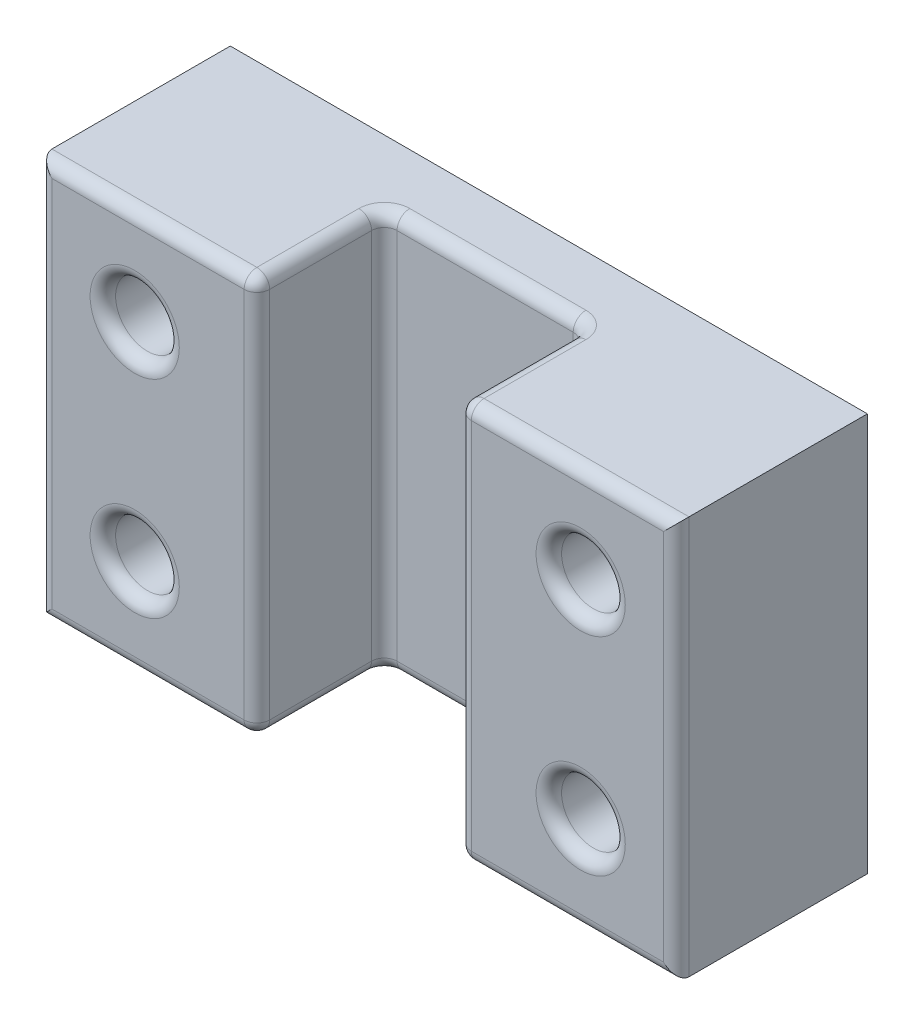
ISO-10303-21;
HEADER;
FILE_DESCRIPTION(('STEP AP214'),'2;1');
FILE_NAME('part.step','',(''),(''),'','','');
FILE_SCHEMA(('AUTOMOTIVE_DESIGN { 1 0 10303 214 1 1 1 1 }'));
ENDSEC;
DATA;
#1=APPLICATION_CONTEXT('core data for automotive mechanical design processes');
#2=APPLICATION_PROTOCOL_DEFINITION('international standard','automotive_design',2000,#1);
#3=PRODUCT_CONTEXT('',#1,'mechanical');
#4=PRODUCT('Part','Part','',(#3));
#5=PRODUCT_RELATED_PRODUCT_CATEGORY('part','',(#4));
#6=PRODUCT_DEFINITION_FORMATION('','',#4);
#7=PRODUCT_DEFINITION_CONTEXT('part definition',#1,'design');
#8=PRODUCT_DEFINITION('design','',#6,#7);
#9=PRODUCT_DEFINITION_SHAPE('','',#8);
#10=(LENGTH_UNIT() NAMED_UNIT(*) SI_UNIT(.MILLI.,.METRE.));
#11=(NAMED_UNIT(*) PLANE_ANGLE_UNIT() SI_UNIT($,.RADIAN.));
#12=(NAMED_UNIT(*) SI_UNIT($,.STERADIAN.) SOLID_ANGLE_UNIT());
#13=UNCERTAINTY_MEASURE_WITH_UNIT(LENGTH_MEASURE(1.E-05),#10,'distance_accuracy_value','');
#14=(GEOMETRIC_REPRESENTATION_CONTEXT(3) GLOBAL_UNCERTAINTY_ASSIGNED_CONTEXT((#13)) GLOBAL_UNIT_ASSIGNED_CONTEXT((#10,
#11,#12)) REPRESENTATION_CONTEXT('',''));
#15=CARTESIAN_POINT('',(0.,0.,0.));
#16=DIRECTION('',(0.,0.,1.));
#17=DIRECTION('',(1.,0.,0.));
#18=AXIS2_PLACEMENT_3D('',#15,#16,#17);
#19=CARTESIAN_POINT('',(0.,0.,38.1));
#20=DIRECTION('',(0.,0.,1.));
#21=DIRECTION('',(1.,0.,0.));
#22=AXIS2_PLACEMENT_3D('',#19,#20,#21);
#23=PLANE('',#22);
#24=CARTESIAN_POINT('',(44.45,-20.6550997782705,38.1));
#25=DIRECTION('',(0.,0.,1.));
#26=DIRECTION('',(1.,0.,0.));
#27=AXIS2_PLACEMENT_3D('',#24,#25,#26);
#28=CIRCLE('',#27,8.89);
#29=CARTESIAN_POINT('',(53.34,-20.6550997782705,38.1));
#30=VERTEX_POINT('',#29);
#31=EDGE_CURVE('E335',#30,#30,#28,.F.);
#32=ORIENTED_EDGE('',*,*,#31,.T.);
#33=EDGE_LOOP('',(#32));
#34=FACE_BOUND('',#33,.T.);
#35=CARTESIAN_POINT('',(44.45,20.6550997782705,38.1));
#36=DIRECTION('',(0.,0.,1.));
#37=DIRECTION('',(1.,0.,0.));
#38=AXIS2_PLACEMENT_3D('',#35,#36,#37);
#39=CIRCLE('',#38,8.89);
#40=CARTESIAN_POINT('',(53.34,20.6550997782705,38.1));
#41=VERTEX_POINT('',#40);
#42=EDGE_CURVE('E331',#41,#41,#39,.F.);
#43=ORIENTED_EDGE('',*,*,#42,.T.);
#44=EDGE_LOOP('',(#43));
#45=FACE_BOUND('',#44,.T.);
#46=DIRECTION('',(0.,1.,0.));
#47=VECTOR('',#46,1.);
#48=CARTESIAN_POINT('',(60.96,39.7050997782705,38.1));
#49=LINE('',#48,#47);
#50=CARTESIAN_POINT('',(60.96,-37.1650997782705,38.1));
#51=VERTEX_POINT('',#50);
#52=CARTESIAN_POINT('',(60.96,37.1650997782705,38.1));
#53=VERTEX_POINT('',#52);
#54=EDGE_CURVE('E324',#51,#53,#49,.T.);
#55=ORIENTED_EDGE('',*,*,#54,.T.);
#56=DIRECTION('',(-1.,0.,0.));
#57=VECTOR('',#56,1.);
#58=CARTESIAN_POINT('',(20.0971534291809,37.1650997782705,38.1));
#59=LINE('',#58,#57);
#60=CARTESIAN_POINT('',(22.6371534291809,37.1650997782705,38.1));
#61=VERTEX_POINT('',#60);
#62=EDGE_CURVE('E327',#53,#61,#59,.T.);
#63=ORIENTED_EDGE('',*,*,#62,.T.);
#64=DIRECTION('',(0.,1.,0.));
#65=VECTOR('',#64,1.);
#66=CARTESIAN_POINT('',(22.6371534291809,-39.7050997782705,38.1));
#67=LINE('',#66,#65);
#68=CARTESIAN_POINT('',(22.6371534291809,-37.1650997782705,38.1));
#69=VERTEX_POINT('',#68);
#70=EDGE_CURVE('E318',#61,#69,#67,.F.);
#71=ORIENTED_EDGE('',*,*,#70,.T.);
#72=DIRECTION('',(1.,0.,0.));
#73=VECTOR('',#72,1.);
#74=CARTESIAN_POINT('',(63.5,-37.1650997782705,38.1));
#75=LINE('',#74,#73);
#76=EDGE_CURVE('E321',#69,#51,#75,.T.);
#77=ORIENTED_EDGE('',*,*,#76,.T.);
#78=EDGE_LOOP('',(#55,#63,#71,#77));
#79=FACE_BOUND('',#78,.T.);
#80=ADVANCED_FACE('F39',(#34,#45,#79),#23,.T.);
#81=CARTESIAN_POINT('',(-44.45,-20.6550997782705,38.1));
#82=DIRECTION('',(0.,0.,1.));
#83=DIRECTION('',(1.,0.,0.));
#84=AXIS2_PLACEMENT_3D('',#81,#82,#83);
#85=CIRCLE('',#84,8.89);
#86=CARTESIAN_POINT('',(-35.56,-20.6550997782705,38.1));
#87=VERTEX_POINT('',#86);
#88=EDGE_CURVE('E48',#87,#87,#85,.F.);
#89=ORIENTED_EDGE('',*,*,#88,.T.);
#90=EDGE_LOOP('',(#89));
#91=FACE_BOUND('',#90,.T.);
#92=CARTESIAN_POINT('',(-44.45,20.6550997782705,38.1));
#93=DIRECTION('',(0.,0.,1.));
#94=DIRECTION('',(1.,0.,0.));
#95=AXIS2_PLACEMENT_3D('',#92,#93,#94);
#96=CIRCLE('',#95,8.89);
#97=CARTESIAN_POINT('',(-35.56,20.6550997782705,38.1));
#98=VERTEX_POINT('',#97);
#99=EDGE_CURVE('E468',#98,#98,#96,.F.);
#100=ORIENTED_EDGE('',*,*,#99,.T.);
#101=EDGE_LOOP('',(#100));
#102=FACE_BOUND('',#101,.T.);
#103=DIRECTION('',(0.,-1.,0.));
#104=VECTOR('',#103,1.);
#105=CARTESIAN_POINT('',(-60.96,-39.7050997782705,38.1));
#106=LINE('',#105,#104);
#107=CARTESIAN_POINT('',(-60.96,37.1650997782705,38.1));
#108=VERTEX_POINT('',#107);
#109=CARTESIAN_POINT('',(-60.96,-37.1650997782705,38.1));
#110=VERTEX_POINT('',#109);
#111=EDGE_CURVE('E304',#108,#110,#106,.T.);
#112=ORIENTED_EDGE('',*,*,#111,.T.);
#113=DIRECTION('',(1.,0.,0.));
#114=VECTOR('',#113,1.);
#115=CARTESIAN_POINT('',(-20.0971534291809,-37.1650997782705,38.1));
#116=LINE('',#115,#114);
#117=CARTESIAN_POINT('',(-22.6371534291809,-37.1650997782705,38.1));
#118=VERTEX_POINT('',#117);
#119=EDGE_CURVE('E307',#110,#118,#116,.T.);
#120=ORIENTED_EDGE('',*,*,#119,.T.);
#121=DIRECTION('',(0.,-1.,0.));
#122=VECTOR('',#121,1.);
#123=CARTESIAN_POINT('',(-22.6371534291809,39.7050997782705,38.1));
#124=LINE('',#123,#122);
#125=CARTESIAN_POINT('',(-22.6371534291809,37.1650997782705,38.1));
#126=VERTEX_POINT('',#125);
#127=EDGE_CURVE('E298',#118,#126,#124,.F.);
#128=ORIENTED_EDGE('',*,*,#127,.T.);
#129=DIRECTION('',(-1.,0.,0.));
#130=VECTOR('',#129,1.);
#131=CARTESIAN_POINT('',(-63.5,37.1650997782705,38.1));
#132=LINE('',#131,#130);
#133=EDGE_CURVE('E301',#126,#108,#132,.T.);
#134=ORIENTED_EDGE('',*,*,#133,.T.);
#135=EDGE_LOOP('',(#112,#120,#128,#134));
#136=FACE_BOUND('',#135,.T.);
#137=ADVANCED_FACE('F475',(#91,#102,#136),#23,.T.);
#138=CARTESIAN_POINT('',(0.,0.,0.));
#139=DIRECTION('',(0.,0.,1.));
#140=DIRECTION('',(1.,0.,0.));
#141=AXIS2_PLACEMENT_3D('',#138,#139,#140);
#142=PLANE('',#141);
#143=DIRECTION('',(0.,1.,0.));
#144=VECTOR('',#143,1.);
#145=CARTESIAN_POINT('',(63.5,39.7050997782705,0.));
#146=LINE('',#145,#144);
#147=CARTESIAN_POINT('',(63.5,-39.7050997782705,0.));
#148=VERTEX_POINT('',#147);
#149=CARTESIAN_POINT('',(63.5,39.7050997782705,0.));
#150=VERTEX_POINT('',#149);
#151=EDGE_CURVE('E197',#148,#150,#146,.T.);
#152=ORIENTED_EDGE('',*,*,#151,.F.);
#153=DIRECTION('',(1.,0.,0.));
#154=VECTOR('',#153,1.);
#155=CARTESIAN_POINT('',(-63.5,-39.7050997782705,0.));
#156=LINE('',#155,#154);
#157=CARTESIAN_POINT('',(-63.5,-39.7050997782705,0.));
#158=VERTEX_POINT('',#157);
#159=EDGE_CURVE('E217',#158,#148,#156,.T.);
#160=ORIENTED_EDGE('',*,*,#159,.F.);
#161=DIRECTION('',(0.,-1.,0.));
#162=VECTOR('',#161,1.);
#163=CARTESIAN_POINT('',(-63.5,39.7050997782705,0.));
#164=LINE('',#163,#162);
#165=CARTESIAN_POINT('',(-63.5,39.7050997782705,0.));
#166=VERTEX_POINT('',#165);
#167=EDGE_CURVE('E199',#166,#158,#164,.T.);
#168=ORIENTED_EDGE('',*,*,#167,.F.);
#169=DIRECTION('',(-1.,0.,0.));
#170=VECTOR('',#169,1.);
#171=CARTESIAN_POINT('',(-63.5,39.7050997782705,0.));
#172=LINE('',#171,#170);
#173=EDGE_CURVE('E181',#150,#166,#172,.T.);
#174=ORIENTED_EDGE('',*,*,#173,.F.);
#175=EDGE_LOOP('',(#152,#160,#168,#174));
#176=FACE_BOUND('',#175,.T.);
#177=CARTESIAN_POINT('',(-44.45,20.6550997782705,0.));
#178=DIRECTION('',(0.,0.,1.));
#179=DIRECTION('',(1.,0.,0.));
#180=AXIS2_PLACEMENT_3D('',#177,#178,#179);
#181=CIRCLE('',#180,6.35);
#182=CARTESIAN_POINT('',(-38.1,20.6550997782705,0.));
#183=VERTEX_POINT('',#182);
#184=EDGE_CURVE('E207',#183,#183,#181,.T.);
#185=ORIENTED_EDGE('',*,*,#184,.T.);
#186=EDGE_LOOP('',(#185));
#187=FACE_BOUND('',#186,.T.);
#188=CARTESIAN_POINT('',(44.45,20.6550997782705,0.));
#189=DIRECTION('',(0.,0.,1.));
#190=DIRECTION('',(-1.,0.,0.));
#191=AXIS2_PLACEMENT_3D('',#188,#189,#190);
#192=CIRCLE('',#191,6.35);
#193=CARTESIAN_POINT('',(38.1,20.6550997782705,0.));
#194=VERTEX_POINT('',#193);
#195=EDGE_CURVE('E211',#194,#194,#192,.T.);
#196=ORIENTED_EDGE('',*,*,#195,.T.);
#197=EDGE_LOOP('',(#196));
#198=FACE_BOUND('',#197,.T.);
#199=CARTESIAN_POINT('',(44.45,-20.6550997782705,0.));
#200=DIRECTION('',(0.,0.,1.));
#201=DIRECTION('',(1.,0.,0.));
#202=AXIS2_PLACEMENT_3D('',#199,#200,#201);
#203=CIRCLE('',#202,6.35);
#204=CARTESIAN_POINT('',(50.8,-20.6550997782705,0.));
#205=VERTEX_POINT('',#204);
#206=EDGE_CURVE('E494',#205,#205,#203,.T.);
#207=ORIENTED_EDGE('',*,*,#206,.T.);
#208=EDGE_LOOP('',(#207));
#209=FACE_BOUND('',#208,.T.);
#210=CARTESIAN_POINT('',(-44.45,-20.6550997782705,0.));
#211=DIRECTION('',(0.,0.,1.));
#212=DIRECTION('',(-1.,0.,0.));
#213=AXIS2_PLACEMENT_3D('',#210,#211,#212);
#214=CIRCLE('',#213,6.35);
#215=CARTESIAN_POINT('',(-50.8,-20.6550997782705,0.));
#216=VERTEX_POINT('',#215);
#217=EDGE_CURVE('E464',#216,#216,#214,.T.);
#218=ORIENTED_EDGE('',*,*,#217,.T.);
#219=EDGE_LOOP('',(#218));
#220=FACE_BOUND('',#219,.T.);
#221=ADVANCED_FACE('F194',(#176,#187,#198,#209,#220),#142,.F.);
#222=CARTESIAN_POINT('',(63.5,39.7050997782705,38.1));
#223=DIRECTION('',(-1.,0.,0.));
#224=DIRECTION('',(0.,0.,1.));
#225=AXIS2_PLACEMENT_3D('',#222,#223,#224);
#226=PLANE('',#225);
#227=DIRECTION('',(0.,0.,-1.));
#228=VECTOR('',#227,1.);
#229=CARTESIAN_POINT('',(63.5,39.7050997782705,38.1));
#230=LINE('',#229,#228);
#231=CARTESIAN_POINT('',(63.5,39.7050997782705,35.56));
#232=VERTEX_POINT('',#231);
#233=EDGE_CURVE('E177',#232,#150,#230,.T.);
#234=ORIENTED_EDGE('',*,*,#233,.F.);
#235=DIRECTION('',(0.,1.,0.));
#236=VECTOR('',#235,1.);
#237=CARTESIAN_POINT('',(63.5,-39.7050997782705,35.56));
#238=LINE('',#237,#236);
#239=CARTESIAN_POINT('',(63.5,-39.7050997782705,35.56));
#240=VERTEX_POINT('',#239);
#241=EDGE_CURVE('E343',#232,#240,#238,.F.);
#242=ORIENTED_EDGE('',*,*,#241,.T.);
#243=DIRECTION('',(0.,0.,-1.));
#244=VECTOR('',#243,1.);
#245=CARTESIAN_POINT('',(63.5,-39.7050997782705,38.1));
#246=LINE('',#245,#244);
#247=EDGE_CURVE('E204',#240,#148,#246,.T.);
#248=ORIENTED_EDGE('',*,*,#247,.T.);
#249=ORIENTED_EDGE('',*,*,#151,.T.);
#250=EDGE_LOOP('',(#234,#242,#248,#249));
#251=FACE_BOUND('',#250,.T.);
#252=ADVANCED_FACE('F202',(#251),#226,.F.);
#253=CARTESIAN_POINT('',(-63.5,39.7050997782705,38.1));
#254=DIRECTION('',(0.,-1.,0.));
#255=DIRECTION('',(0.,0.,-1.));
#256=AXIS2_PLACEMENT_3D('',#253,#254,#255);
#257=PLANE('',#256);
#258=DIRECTION('',(0.,0.,-1.));
#259=VECTOR('',#258,1.);
#260=CARTESIAN_POINT('',(-63.5,39.7050997782705,38.1));
#261=LINE('',#260,#259);
#262=CARTESIAN_POINT('',(-63.5,39.7050997782705,35.56));
#263=VERTEX_POINT('',#262);
#264=EDGE_CURVE('E190',#263,#166,#261,.T.);
#265=ORIENTED_EDGE('',*,*,#264,.F.);
#266=DIRECTION('',(-1.,0.,0.));
#267=VECTOR('',#266,1.);
#268=CARTESIAN_POINT('',(-20.0971534291809,39.7050997782705,35.56));
#269=LINE('',#268,#267);
#270=CARTESIAN_POINT('',(-22.6371534291809,39.7050997782705,35.56));
#271=VERTEX_POINT('',#270);
#272=EDGE_CURVE('E295',#263,#271,#269,.F.);
#273=ORIENTED_EDGE('',*,*,#272,.T.);
#274=DIRECTION('',(0.,0.,1.));
#275=VECTOR('',#274,1.);
#276=CARTESIAN_POINT('',(-22.6371534291809,39.7050997782705,38.1));
#277=LINE('',#276,#275);
#278=CARTESIAN_POINT('',(-22.6371534291809,39.7050997782705,15.24));
#279=VERTEX_POINT('',#278);
#280=EDGE_CURVE('E290',#271,#279,#277,.F.);
#281=ORIENTED_EDGE('',*,*,#280,.T.);
#282=CARTESIAN_POINT('',(-17.5571534291809,39.7050997782705,15.24));
#283=DIRECTION('',(0.,-1.,0.));
#284=DIRECTION('',(0.,0.,-1.));
#285=AXIS2_PLACEMENT_3D('',#282,#283,#284);
#286=CIRCLE('',#285,5.08);
#287=CARTESIAN_POINT('',(-17.5571534291809,39.7050997782705,10.16));
#288=VERTEX_POINT('',#287);
#289=EDGE_CURVE('E286',#288,#279,#286,.F.);
#290=ORIENTED_EDGE('',*,*,#289,.F.);
#291=DIRECTION('',(-1.,0.,0.));
#292=VECTOR('',#291,1.);
#293=CARTESIAN_POINT('',(20.0971534291809,39.7050997782705,10.16));
#294=LINE('',#293,#292);
#295=CARTESIAN_POINT('',(17.5571534291809,39.7050997782705,10.16));
#296=VERTEX_POINT('',#295);
#297=EDGE_CURVE('E280',#288,#296,#294,.F.);
#298=ORIENTED_EDGE('',*,*,#297,.T.);
#299=CARTESIAN_POINT('',(17.5571534291809,39.7050997782705,15.24));
#300=DIRECTION('',(0.,-1.,0.));
#301=DIRECTION('',(0.,0.,-1.));
#302=AXIS2_PLACEMENT_3D('',#299,#300,#301);
#303=CIRCLE('',#302,5.08);
#304=CARTESIAN_POINT('',(22.6371534291809,39.7050997782705,15.24));
#305=VERTEX_POINT('',#304);
#306=EDGE_CURVE('E276',#305,#296,#303,.F.);
#307=ORIENTED_EDGE('',*,*,#306,.F.);
#308=DIRECTION('',(0.,0.,1.));
#309=VECTOR('',#308,1.);
#310=CARTESIAN_POINT('',(22.6371534291809,39.7050997782705,38.1));
#311=LINE('',#310,#309);
#312=CARTESIAN_POINT('',(22.6371534291809,39.7050997782705,35.56));
#313=VERTEX_POINT('',#312);
#314=EDGE_CURVE('E283',#305,#313,#311,.T.);
#315=ORIENTED_EDGE('',*,*,#314,.T.);
#316=DIRECTION('',(-1.,0.,0.));
#317=VECTOR('',#316,1.);
#318=CARTESIAN_POINT('',(63.5,39.7050997782705,35.56));
#319=LINE('',#318,#317);
#320=EDGE_CURVE('E184',#313,#232,#319,.F.);
#321=ORIENTED_EDGE('',*,*,#320,.T.);
#322=ORIENTED_EDGE('',*,*,#233,.T.);
#323=ORIENTED_EDGE('',*,*,#173,.T.);
#324=EDGE_LOOP('',(#265,#273,#281,#290,#298,#307,#315,#321,#322,#323));
#325=FACE_BOUND('',#324,.T.);
#326=ADVANCED_FACE('F180',(#325),#257,.F.);
#327=CARTESIAN_POINT('',(-63.5,39.7050997782705,38.1));
#328=DIRECTION('',(1.,0.,0.));
#329=DIRECTION('',(0.,0.,-1.));
#330=AXIS2_PLACEMENT_3D('',#327,#328,#329);
#331=PLANE('',#330);
#332=DIRECTION('',(0.,0.,-1.));
#333=VECTOR('',#332,1.);
#334=CARTESIAN_POINT('',(-63.5,-39.7050997782705,38.1));
#335=LINE('',#334,#333);
#336=CARTESIAN_POINT('',(-63.5,-39.7050997782705,35.56));
#337=VERTEX_POINT('',#336);
#338=EDGE_CURVE('E222',#337,#158,#335,.T.);
#339=ORIENTED_EDGE('',*,*,#338,.F.);
#340=DIRECTION('',(0.,-1.,0.));
#341=VECTOR('',#340,1.);
#342=CARTESIAN_POINT('',(-63.5,39.7050997782705,35.56));
#343=LINE('',#342,#341);
#344=EDGE_CURVE('E311',#337,#263,#343,.F.);
#345=ORIENTED_EDGE('',*,*,#344,.T.);
#346=ORIENTED_EDGE('',*,*,#264,.T.);
#347=ORIENTED_EDGE('',*,*,#167,.T.);
#348=EDGE_LOOP('',(#339,#345,#346,#347));
#349=FACE_BOUND('',#348,.T.);
#350=ADVANCED_FACE('F531',(#349),#331,.F.);
#351=CARTESIAN_POINT('',(-63.5,-39.7050997782705,38.1));
#352=DIRECTION('',(0.,1.,0.));
#353=DIRECTION('',(0.,0.,1.));
#354=AXIS2_PLACEMENT_3D('',#351,#352,#353);
#355=PLANE('',#354);
#356=DIRECTION('',(0.,0.,1.));
#357=VECTOR('',#356,1.);
#358=CARTESIAN_POINT('',(-22.6371534291809,-39.7050997782705,38.1));
#359=LINE('',#358,#357);
#360=CARTESIAN_POINT('',(-22.6371534291809,-39.7050997782705,15.24));
#361=VERTEX_POINT('',#360);
#362=CARTESIAN_POINT('',(-22.6371534291809,-39.7050997782705,35.56));
#363=VERTEX_POINT('',#362);
#364=EDGE_CURVE('E240',#361,#363,#359,.T.);
#365=ORIENTED_EDGE('',*,*,#364,.T.);
#366=DIRECTION('',(1.,0.,0.));
#367=VECTOR('',#366,1.);
#368=CARTESIAN_POINT('',(-63.5,-39.7050997782705,35.56));
#369=LINE('',#368,#367);
#370=EDGE_CURVE('E247',#363,#337,#369,.F.);
#371=ORIENTED_EDGE('',*,*,#370,.T.);
#372=ORIENTED_EDGE('',*,*,#338,.T.);
#373=ORIENTED_EDGE('',*,*,#159,.T.);
#374=ORIENTED_EDGE('',*,*,#247,.F.);
#375=DIRECTION('',(1.,0.,0.));
#376=VECTOR('',#375,1.);
#377=CARTESIAN_POINT('',(20.0971534291809,-39.7050997782705,35.56));
#378=LINE('',#377,#376);
#379=CARTESIAN_POINT('',(22.6371534291809,-39.7050997782705,35.56));
#380=VERTEX_POINT('',#379);
#381=EDGE_CURVE('E244',#240,#380,#378,.F.);
#382=ORIENTED_EDGE('',*,*,#381,.T.);
#383=DIRECTION('',(0.,0.,1.));
#384=VECTOR('',#383,1.);
#385=CARTESIAN_POINT('',(22.6371534291809,-39.7050997782705,38.1));
#386=LINE('',#385,#384);
#387=CARTESIAN_POINT('',(22.6371534291809,-39.7050997782705,15.24));
#388=VERTEX_POINT('',#387);
#389=EDGE_CURVE('E237',#380,#388,#386,.F.);
#390=ORIENTED_EDGE('',*,*,#389,.T.);
#391=CARTESIAN_POINT('',(17.5571534291809,-39.7050997782705,15.24));
#392=DIRECTION('',(0.,1.,0.));
#393=DIRECTION('',(0.,0.,1.));
#394=AXIS2_PLACEMENT_3D('',#391,#392,#393);
#395=CIRCLE('',#394,5.08);
#396=CARTESIAN_POINT('',(17.5571534291809,-39.7050997782705,10.16));
#397=VERTEX_POINT('',#396);
#398=EDGE_CURVE('E233',#397,#388,#395,.F.);
#399=ORIENTED_EDGE('',*,*,#398,.F.);
#400=DIRECTION('',(1.,0.,0.));
#401=VECTOR('',#400,1.);
#402=CARTESIAN_POINT('',(-20.0971534291809,-39.7050997782705,10.16));
#403=LINE('',#402,#401);
#404=CARTESIAN_POINT('',(-17.5571534291809,-39.7050997782705,10.16));
#405=VERTEX_POINT('',#404);
#406=EDGE_CURVE('E230',#397,#405,#403,.F.);
#407=ORIENTED_EDGE('',*,*,#406,.T.);
#408=CARTESIAN_POINT('',(-17.5571534291809,-39.7050997782705,15.24));
#409=DIRECTION('',(0.,1.,0.));
#410=DIRECTION('',(0.,0.,1.));
#411=AXIS2_PLACEMENT_3D('',#408,#409,#410);
#412=CIRCLE('',#411,5.08);
#413=EDGE_CURVE('E189',#361,#405,#412,.F.);
#414=ORIENTED_EDGE('',*,*,#413,.F.);
#415=EDGE_LOOP('',(#365,#371,#372,#373,#374,#382,#390,#399,#407,#414));
#416=FACE_BOUND('',#415,.T.);
#417=ADVANCED_FACE('F516',(#416),#355,.F.);
#418=CARTESIAN_POINT('',(-44.45,20.6550997782705,38.1));
#419=DIRECTION('',(0.,0.,-1.));
#420=DIRECTION('',(-1.,0.,0.));
#421=AXIS2_PLACEMENT_3D('',#418,#419,#420);
#422=CYLINDRICAL_SURFACE('',#421,6.35);
#423=CARTESIAN_POINT('',(-44.45,20.6550997782705,35.56));
#424=DIRECTION('',(0.,0.,1.));
#425=DIRECTION('',(1.,0.,0.));
#426=AXIS2_PLACEMENT_3D('',#423,#424,#425);
#427=CIRCLE('',#426,6.35);
#428=CARTESIAN_POINT('',(-38.1,20.6550997782705,35.56));
#429=VERTEX_POINT('',#428);
#430=EDGE_CURVE('E11',#429,#429,#427,.T.);
#431=ORIENTED_EDGE('',*,*,#430,.T.);
#432=EDGE_LOOP('',(#431));
#433=FACE_BOUND('',#432,.T.);
#434=ORIENTED_EDGE('',*,*,#184,.F.);
#435=EDGE_LOOP('',(#434));
#436=FACE_BOUND('',#435,.T.);
#437=ADVANCED_FACE('F507',(#433,#436),#422,.F.);
#438=CARTESIAN_POINT('',(44.45,20.6550997782705,38.1));
#439=DIRECTION('',(0.,0.,-1.));
#440=DIRECTION('',(-1.,0.,0.));
#441=AXIS2_PLACEMENT_3D('',#438,#439,#440);
#442=CYLINDRICAL_SURFACE('',#441,6.35);
#443=CARTESIAN_POINT('',(44.45,20.6550997782705,35.56));
#444=DIRECTION('',(0.,0.,1.));
#445=DIRECTION('',(1.,0.,0.));
#446=AXIS2_PLACEMENT_3D('',#443,#444,#445);
#447=CIRCLE('',#446,6.35);
#448=CARTESIAN_POINT('',(50.8,20.6550997782705,35.56));
#449=VERTEX_POINT('',#448);
#450=EDGE_CURVE('E339',#449,#449,#447,.T.);
#451=ORIENTED_EDGE('',*,*,#450,.T.);
#452=EDGE_LOOP('',(#451));
#453=FACE_BOUND('',#452,.T.);
#454=ORIENTED_EDGE('',*,*,#195,.F.);
#455=EDGE_LOOP('',(#454));
#456=FACE_BOUND('',#455,.T.);
#457=ADVANCED_FACE('F505',(#453,#456),#442,.F.);
#458=CARTESIAN_POINT('',(44.45,-20.6550997782705,38.1));
#459=DIRECTION('',(0.,0.,-1.));
#460=DIRECTION('',(-1.,0.,0.));
#461=AXIS2_PLACEMENT_3D('',#458,#459,#460);
#462=CYLINDRICAL_SURFACE('',#461,6.35);
#463=CARTESIAN_POINT('',(44.45,-20.6550997782705,35.56));
#464=DIRECTION('',(0.,0.,1.));
#465=DIRECTION('',(1.,0.,0.));
#466=AXIS2_PLACEMENT_3D('',#463,#464,#465);
#467=CIRCLE('',#466,6.35);
#468=CARTESIAN_POINT('',(50.8,-20.6550997782705,35.56));
#469=VERTEX_POINT('',#468);
#470=EDGE_CURVE('E314',#469,#469,#467,.T.);
#471=ORIENTED_EDGE('',*,*,#470,.T.);
#472=EDGE_LOOP('',(#471));
#473=FACE_BOUND('',#472,.T.);
#474=ORIENTED_EDGE('',*,*,#206,.F.);
#475=EDGE_LOOP('',(#474));
#476=FACE_BOUND('',#475,.T.);
#477=ADVANCED_FACE('F488',(#473,#476),#462,.F.);
#478=CARTESIAN_POINT('',(-44.45,-20.6550997782705,38.1));
#479=DIRECTION('',(0.,0.,-1.));
#480=DIRECTION('',(-1.,0.,0.));
#481=AXIS2_PLACEMENT_3D('',#478,#479,#480);
#482=CYLINDRICAL_SURFACE('',#481,6.35);
#483=CARTESIAN_POINT('',(-44.45,-20.6550997782705,35.56));
#484=DIRECTION('',(0.,0.,1.));
#485=DIRECTION('',(1.,0.,0.));
#486=AXIS2_PLACEMENT_3D('',#483,#484,#485);
#487=CIRCLE('',#486,6.35);
#488=CARTESIAN_POINT('',(-38.1,-20.6550997782705,35.56));
#489=VERTEX_POINT('',#488);
#490=EDGE_CURVE('E356',#489,#489,#487,.T.);
#491=ORIENTED_EDGE('',*,*,#490,.T.);
#492=EDGE_LOOP('',(#491));
#493=FACE_BOUND('',#492,.T.);
#494=ORIENTED_EDGE('',*,*,#217,.F.);
#495=EDGE_LOOP('',(#494));
#496=FACE_BOUND('',#495,.T.);
#497=ADVANCED_FACE('F484',(#493,#496),#482,.F.);
#498=CARTESIAN_POINT('',(20.0971534291809,39.7050997782705,12.7));
#499=DIRECTION('',(1.,0.,0.));
#500=DIRECTION('',(0.,0.,-1.));
#501=AXIS2_PLACEMENT_3D('',#498,#499,#500);
#502=PLANE('',#501);
#503=DIRECTION('',(0.,0.,1.));
#504=VECTOR('',#503,1.);
#505=CARTESIAN_POINT('',(20.0971534291809,-37.1650997782705,12.7));
#506=LINE('',#505,#504);
#507=CARTESIAN_POINT('',(20.0971534291809,-37.1650997782705,15.24));
#508=VERTEX_POINT('',#507);
#509=CARTESIAN_POINT('',(20.0971534291809,-37.1650997782705,35.56));
#510=VERTEX_POINT('',#509);
#511=EDGE_CURVE('E269',#508,#510,#506,.T.);
#512=ORIENTED_EDGE('',*,*,#511,.T.);
#513=DIRECTION('',(0.,1.,0.));
#514=VECTOR('',#513,1.);
#515=CARTESIAN_POINT('',(20.0971534291809,39.7050997782705,35.56));
#516=LINE('',#515,#514);
#517=CARTESIAN_POINT('',(20.0971534291809,37.1650997782705,35.56));
#518=VERTEX_POINT('',#517);
#519=EDGE_CURVE('E273',#510,#518,#516,.T.);
#520=ORIENTED_EDGE('',*,*,#519,.T.);
#521=DIRECTION('',(0.,0.,1.));
#522=VECTOR('',#521,1.);
#523=CARTESIAN_POINT('',(20.0971534291809,37.1650997782705,12.7));
#524=LINE('',#523,#522);
#525=CARTESIAN_POINT('',(20.0971534291809,37.1650997782705,15.24));
#526=VERTEX_POINT('',#525);
#527=EDGE_CURVE('E266',#518,#526,#524,.F.);
#528=ORIENTED_EDGE('',*,*,#527,.T.);
#529=DIRECTION('',(0.,1.,0.));
#530=VECTOR('',#529,1.);
#531=CARTESIAN_POINT('',(20.0971534291809,39.7050997782705,15.24));
#532=LINE('',#531,#530);
#533=EDGE_CURVE('E263',#526,#508,#532,.F.);
#534=ORIENTED_EDGE('',*,*,#533,.T.);
#535=EDGE_LOOP('',(#512,#520,#528,#534));
#536=FACE_BOUND('',#535,.T.);
#537=ADVANCED_FACE('F487',(#536),#502,.F.);
#538=CARTESIAN_POINT('',(-20.0971534291809,39.7050997782705,12.7));
#539=DIRECTION('',(-1.,0.,0.));
#540=DIRECTION('',(0.,0.,1.));
#541=AXIS2_PLACEMENT_3D('',#538,#539,#540);
#542=PLANE('',#541);
#543=DIRECTION('',(0.,0.,1.));
#544=VECTOR('',#543,1.);
#545=CARTESIAN_POINT('',(-20.0971534291809,37.1650997782705,12.7));
#546=LINE('',#545,#544);
#547=CARTESIAN_POINT('',(-20.0971534291809,37.1650997782705,15.24));
#548=VERTEX_POINT('',#547);
#549=CARTESIAN_POINT('',(-20.0971534291809,37.1650997782705,35.56));
#550=VERTEX_POINT('',#549);
#551=EDGE_CURVE('E253',#548,#550,#546,.T.);
#552=ORIENTED_EDGE('',*,*,#551,.T.);
#553=DIRECTION('',(0.,-1.,0.));
#554=VECTOR('',#553,1.);
#555=CARTESIAN_POINT('',(-20.0971534291809,-39.7050997782705,35.56));
#556=LINE('',#555,#554);
#557=CARTESIAN_POINT('',(-20.0971534291809,-37.1650997782705,35.56));
#558=VERTEX_POINT('',#557);
#559=EDGE_CURVE('E260',#550,#558,#556,.T.);
#560=ORIENTED_EDGE('',*,*,#559,.T.);
#561=DIRECTION('',(0.,0.,1.));
#562=VECTOR('',#561,1.);
#563=CARTESIAN_POINT('',(-20.0971534291809,-37.1650997782705,12.7));
#564=LINE('',#563,#562);
#565=CARTESIAN_POINT('',(-20.0971534291809,-37.1650997782705,15.24));
#566=VERTEX_POINT('',#565);
#567=EDGE_CURVE('E256',#558,#566,#564,.F.);
#568=ORIENTED_EDGE('',*,*,#567,.T.);
#569=DIRECTION('',(0.,-1.,0.));
#570=VECTOR('',#569,1.);
#571=CARTESIAN_POINT('',(-20.0971534291809,39.7050997782705,15.24));
#572=LINE('',#571,#570);
#573=EDGE_CURVE('E250',#566,#548,#572,.F.);
#574=ORIENTED_EDGE('',*,*,#573,.T.);
#575=EDGE_LOOP('',(#552,#560,#568,#574));
#576=FACE_BOUND('',#575,.T.);
#577=ADVANCED_FACE('F676',(#576),#542,.F.);
#578=CARTESIAN_POINT('',(0.,0.,12.7));
#579=DIRECTION('',(0.,0.,1.));
#580=DIRECTION('',(1.,0.,0.));
#581=AXIS2_PLACEMENT_3D('',#578,#579,#580);
#582=PLANE('',#581);
#583=DIRECTION('',(0.,-1.,0.));
#584=VECTOR('',#583,1.);
#585=CARTESIAN_POINT('',(-17.5571534291809,0.,12.7));
#586=LINE('',#585,#584);
#587=CARTESIAN_POINT('',(-17.5571534291809,37.1650997782705,12.7));
#588=VERTEX_POINT('',#587);
#589=CARTESIAN_POINT('',(-17.5571534291809,-37.1650997782705,12.7));
#590=VERTEX_POINT('',#589);
#591=EDGE_CURVE('E55',#588,#590,#586,.T.);
#592=ORIENTED_EDGE('',*,*,#591,.T.);
#593=DIRECTION('',(1.,0.,0.));
#594=VECTOR('',#593,1.);
#595=CARTESIAN_POINT('',(20.0971534291809,-37.1650997782705,12.7));
#596=LINE('',#595,#594);
#597=CARTESIAN_POINT('',(17.5571534291809,-37.1650997782705,12.7));
#598=VERTEX_POINT('',#597);
#599=EDGE_CURVE('E353',#590,#598,#596,.T.);
#600=ORIENTED_EDGE('',*,*,#599,.T.);
#601=DIRECTION('',(0.,1.,0.));
#602=VECTOR('',#601,1.);
#603=CARTESIAN_POINT('',(17.5571534291809,0.,12.7));
#604=LINE('',#603,#602);
#605=CARTESIAN_POINT('',(17.5571534291809,37.1650997782705,12.7));
#606=VERTEX_POINT('',#605);
#607=EDGE_CURVE('E346',#598,#606,#604,.T.);
#608=ORIENTED_EDGE('',*,*,#607,.T.);
#609=DIRECTION('',(-1.,0.,0.));
#610=VECTOR('',#609,1.);
#611=CARTESIAN_POINT('',(-20.0971534291809,37.1650997782705,12.7));
#612=LINE('',#611,#610);
#613=EDGE_CURVE('E60',#606,#588,#612,.T.);
#614=ORIENTED_EDGE('',*,*,#613,.T.);
#615=EDGE_LOOP('',(#592,#600,#608,#614));
#616=FACE_BOUND('',#615,.T.);
#617=ADVANCED_FACE('F636',(#616),#582,.T.);
#618=CARTESIAN_POINT('',(0.,37.1650997782705,35.56));
#619=DIRECTION('',(1.,0.,0.));
#620=DIRECTION('',(0.,0.,-1.));
#621=AXIS2_PLACEMENT_3D('',#618,#619,#620);
#622=CYLINDRICAL_SURFACE('',#621,2.54);
#623=CARTESIAN_POINT('',(22.6371534291809,37.1650997782705,35.56));
#624=DIRECTION('',(-1.,0.,0.));
#625=DIRECTION('',(0.,0.,1.));
#626=AXIS2_PLACEMENT_3D('',#623,#624,#625);
#627=CIRCLE('',#626,2.54);
#628=EDGE_CURVE('E460',#61,#313,#627,.T.);
#629=ORIENTED_EDGE('',*,*,#628,.F.);
#630=ORIENTED_EDGE('',*,*,#62,.F.);
#631=CARTESIAN_POINT('',(60.96,37.1650997782705,35.56));
#632=DIRECTION('',(0.707106781186547,-0.707106781186547,0.));
#633=DIRECTION('',(-0.707106781186547,-0.707106781186547,0.));
#634=AXIS2_PLACEMENT_3D('',#631,#632,#633);
#635=ELLIPSE('',#634,3.59210244842766,2.54);
#636=EDGE_CURVE('E456',#232,#53,#635,.T.);
#637=ORIENTED_EDGE('',*,*,#636,.F.);
#638=ORIENTED_EDGE('',*,*,#320,.F.);
#639=EDGE_LOOP('',(#629,#630,#637,#638));
#640=FACE_BOUND('',#639,.T.);
#641=ADVANCED_FACE('F632',(#640),#622,.T.);
#642=CARTESIAN_POINT('',(22.6371534291809,37.1650997782705,35.56));
#643=DIRECTION('',(0.,1.,0.));
#644=DIRECTION('',(0.,0.,1.));
#645=AXIS2_PLACEMENT_3D('',#642,#643,#644);
#646=SPHERICAL_SURFACE('',#645,2.54);
#647=CARTESIAN_POINT('',(22.6371534291809,37.1650997782705,35.56));
#648=DIRECTION('',(0.,1.,0.));
#649=DIRECTION('',(0.,0.,1.));
#650=AXIS2_PLACEMENT_3D('',#647,#648,#649);
#651=CIRCLE('',#650,2.54);
#652=EDGE_CURVE('E448',#61,#518,#651,.F.);
#653=ORIENTED_EDGE('',*,*,#652,.F.);
#654=ORIENTED_EDGE('',*,*,#628,.T.);
#655=CARTESIAN_POINT('',(22.6371534291809,37.1650997782705,35.56));
#656=DIRECTION('',(0.,0.,1.));
#657=DIRECTION('',(1.,0.,0.));
#658=AXIS2_PLACEMENT_3D('',#655,#656,#657);
#659=CIRCLE('',#658,2.54);
#660=EDGE_CURVE('E452',#518,#313,#659,.F.);
#661=ORIENTED_EDGE('',*,*,#660,.F.);
#662=EDGE_LOOP('',(#653,#654,#661));
#663=FACE_BOUND('',#662,.T.);
#664=ADVANCED_FACE('F628',(#663),#646,.T.);
#665=CARTESIAN_POINT('',(60.96,0.,35.56));
#666=DIRECTION('',(0.,-1.,0.));
#667=DIRECTION('',(0.,0.,-1.));
#668=AXIS2_PLACEMENT_3D('',#665,#666,#667);
#669=CYLINDRICAL_SURFACE('',#668,2.54);
#670=ORIENTED_EDGE('',*,*,#636,.T.);
#671=ORIENTED_EDGE('',*,*,#54,.F.);
#672=CARTESIAN_POINT('',(60.96,-37.1650997782705,35.56));
#673=DIRECTION('',(-0.707106781186547,-0.707106781186547,0.));
#674=DIRECTION('',(-0.707106781186547,0.707106781186547,0.));
#675=AXIS2_PLACEMENT_3D('',#672,#673,#674);
#676=ELLIPSE('',#675,3.59210244842766,2.54);
#677=EDGE_CURVE('E444',#240,#51,#676,.T.);
#678=ORIENTED_EDGE('',*,*,#677,.F.);
#679=ORIENTED_EDGE('',*,*,#241,.F.);
#680=EDGE_LOOP('',(#670,#671,#678,#679));
#681=FACE_BOUND('',#680,.T.);
#682=ADVANCED_FACE('F624',(#681),#669,.T.);
#683=CARTESIAN_POINT('',(22.6371534291809,37.1650997782705,38.1));
#684=DIRECTION('',(0.,0.,1.));
#685=DIRECTION('',(1.,0.,0.));
#686=AXIS2_PLACEMENT_3D('',#683,#684,#685);
#687=CYLINDRICAL_SURFACE('',#686,2.54);
#688=ORIENTED_EDGE('',*,*,#660,.T.);
#689=ORIENTED_EDGE('',*,*,#314,.F.);
#690=CARTESIAN_POINT('',(22.6371534291809,37.1650997782705,15.24));
#691=DIRECTION('',(0.,0.,-1.));
#692=DIRECTION('',(-1.,0.,0.));
#693=AXIS2_PLACEMENT_3D('',#690,#691,#692);
#694=CIRCLE('',#693,2.54);
#695=EDGE_CURVE('E440',#526,#305,#694,.T.);
#696=ORIENTED_EDGE('',*,*,#695,.F.);
#697=ORIENTED_EDGE('',*,*,#527,.F.);
#698=EDGE_LOOP('',(#688,#689,#696,#697));
#699=FACE_BOUND('',#698,.T.);
#700=ADVANCED_FACE('F620',(#699),#687,.T.);
#701=CARTESIAN_POINT('',(22.6371534291809,39.7050997782705,35.56));
#702=DIRECTION('',(0.,-1.,0.));
#703=DIRECTION('',(0.,0.,-1.));
#704=AXIS2_PLACEMENT_3D('',#701,#702,#703);
#705=CYLINDRICAL_SURFACE('',#704,2.54);
#706=ORIENTED_EDGE('',*,*,#652,.T.);
#707=ORIENTED_EDGE('',*,*,#519,.F.);
#708=CARTESIAN_POINT('',(22.6371534291809,-37.1650997782705,35.56));
#709=DIRECTION('',(0.,-1.,0.));
#710=DIRECTION('',(0.,0.,-1.));
#711=AXIS2_PLACEMENT_3D('',#708,#709,#710);
#712=CIRCLE('',#711,2.54);
#713=EDGE_CURVE('E436',#69,#510,#712,.T.);
#714=ORIENTED_EDGE('',*,*,#713,.F.);
#715=ORIENTED_EDGE('',*,*,#70,.F.);
#716=EDGE_LOOP('',(#706,#707,#714,#715));
#717=FACE_BOUND('',#716,.T.);
#718=ADVANCED_FACE('F616',(#717),#705,.T.);
#719=CARTESIAN_POINT('',(0.,-37.1650997782705,35.56));
#720=DIRECTION('',(-1.,0.,0.));
#721=DIRECTION('',(0.,0.,1.));
#722=AXIS2_PLACEMENT_3D('',#719,#720,#721);
#723=CYLINDRICAL_SURFACE('',#722,2.54);
#724=ORIENTED_EDGE('',*,*,#677,.T.);
#725=ORIENTED_EDGE('',*,*,#76,.F.);
#726=CARTESIAN_POINT('',(22.6371534291809,-37.1650997782705,35.56));
#727=DIRECTION('',(-1.,0.,0.));
#728=DIRECTION('',(0.,0.,1.));
#729=AXIS2_PLACEMENT_3D('',#726,#727,#728);
#730=CIRCLE('',#729,2.54);
#731=EDGE_CURVE('E432',#380,#69,#730,.T.);
#732=ORIENTED_EDGE('',*,*,#731,.F.);
#733=ORIENTED_EDGE('',*,*,#381,.F.);
#734=EDGE_LOOP('',(#724,#725,#732,#733));
#735=FACE_BOUND('',#734,.T.);
#736=ADVANCED_FACE('F612',(#735),#723,.T.);
#737=CARTESIAN_POINT('',(17.5571534291809,37.1650997782705,15.24));
#738=DIRECTION('',(0.,-1.,0.));
#739=DIRECTION('',(0.,0.,-1.));
#740=AXIS2_PLACEMENT_3D('',#737,#738,#739);
#741=TOROIDAL_SURFACE('',#740,5.08,2.54);
#742=ORIENTED_EDGE('',*,*,#695,.T.);
#743=ORIENTED_EDGE('',*,*,#306,.T.);
#744=CARTESIAN_POINT('',(17.5571534291809,37.1650997782705,10.16));
#745=DIRECTION('',(1.,0.,0.));
#746=DIRECTION('',(0.,0.,-1.));
#747=AXIS2_PLACEMENT_3D('',#744,#745,#746);
#748=CIRCLE('',#747,2.54);
#749=EDGE_CURVE('E428',#606,#296,#748,.F.);
#750=ORIENTED_EDGE('',*,*,#749,.F.);
#751=CARTESIAN_POINT('',(17.5571534291809,37.1650997782705,15.24));
#752=DIRECTION('',(0.,-1.,0.));
#753=DIRECTION('',(0.,0.,-1.));
#754=AXIS2_PLACEMENT_3D('',#751,#752,#753);
#755=CIRCLE('',#754,2.54);
#756=EDGE_CURVE('E424',#526,#606,#755,.F.);
#757=ORIENTED_EDGE('',*,*,#756,.F.);
#758=EDGE_LOOP('',(#742,#743,#750,#757));
#759=FACE_BOUND('',#758,.T.);
#760=ADVANCED_FACE('F608',(#759),#741,.T.);
#761=CARTESIAN_POINT('',(22.6371534291809,-37.1650997782705,35.56));
#762=DIRECTION('',(0.,0.,1.));
#763=DIRECTION('',(1.,0.,0.));
#764=AXIS2_PLACEMENT_3D('',#761,#762,#763);
#765=SPHERICAL_SURFACE('',#764,2.54);
#766=ORIENTED_EDGE('',*,*,#731,.T.);
#767=ORIENTED_EDGE('',*,*,#713,.T.);
#768=CARTESIAN_POINT('',(22.6371534291809,-37.1650997782705,35.56));
#769=DIRECTION('',(0.,0.,1.));
#770=DIRECTION('',(1.,0.,0.));
#771=AXIS2_PLACEMENT_3D('',#768,#769,#770);
#772=CIRCLE('',#771,2.54);
#773=EDGE_CURVE('E421',#380,#510,#772,.F.);
#774=ORIENTED_EDGE('',*,*,#773,.F.);
#775=EDGE_LOOP('',(#766,#767,#774));
#776=FACE_BOUND('',#775,.T.);
#777=ADVANCED_FACE('F604',(#776),#765,.T.);
#778=CARTESIAN_POINT('',(0.,37.1650997782705,10.16));
#779=DIRECTION('',(1.,0.,0.));
#780=DIRECTION('',(0.,0.,-1.));
#781=AXIS2_PLACEMENT_3D('',#778,#779,#780);
#782=CYLINDRICAL_SURFACE('',#781,2.54);
#783=ORIENTED_EDGE('',*,*,#749,.T.);
#784=ORIENTED_EDGE('',*,*,#297,.F.);
#785=CARTESIAN_POINT('',(-17.5571534291809,37.1650997782705,10.16));
#786=DIRECTION('',(-1.,0.,0.));
#787=DIRECTION('',(0.,0.,1.));
#788=AXIS2_PLACEMENT_3D('',#785,#786,#787);
#789=CIRCLE('',#788,2.54);
#790=EDGE_CURVE('E413',#588,#288,#789,.T.);
#791=ORIENTED_EDGE('',*,*,#790,.F.);
#792=ORIENTED_EDGE('',*,*,#613,.F.);
#793=EDGE_LOOP('',(#783,#784,#791,#792));
#794=FACE_BOUND('',#793,.T.);
#795=ADVANCED_FACE('F600',(#794),#782,.T.);
#796=CARTESIAN_POINT('',(17.5571534291809,0.,15.24));
#797=DIRECTION('',(0.,1.,0.));
#798=DIRECTION('',(0.,0.,1.));
#799=AXIS2_PLACEMENT_3D('',#796,#797,#798);
#800=CYLINDRICAL_SURFACE('',#799,2.54);
#801=ORIENTED_EDGE('',*,*,#756,.T.);
#802=ORIENTED_EDGE('',*,*,#607,.F.);
#803=CARTESIAN_POINT('',(17.5571534291809,-37.1650997782705,15.24));
#804=DIRECTION('',(0.,1.,0.));
#805=DIRECTION('',(0.,0.,1.));
#806=AXIS2_PLACEMENT_3D('',#803,#804,#805);
#807=CIRCLE('',#806,2.54);
#808=EDGE_CURVE('E409',#508,#598,#807,.T.);
#809=ORIENTED_EDGE('',*,*,#808,.F.);
#810=ORIENTED_EDGE('',*,*,#533,.F.);
#811=EDGE_LOOP('',(#801,#802,#809,#810));
#812=FACE_BOUND('',#811,.T.);
#813=ADVANCED_FACE('F596',(#812),#800,.F.);
#814=CARTESIAN_POINT('',(22.6371534291809,-37.1650997782705,12.7));
#815=DIRECTION('',(0.,0.,1.));
#816=DIRECTION('',(1.,0.,0.));
#817=AXIS2_PLACEMENT_3D('',#814,#815,#816);
#818=CYLINDRICAL_SURFACE('',#817,2.54);
#819=ORIENTED_EDGE('',*,*,#773,.T.);
#820=ORIENTED_EDGE('',*,*,#511,.F.);
#821=CARTESIAN_POINT('',(22.6371534291809,-37.1650997782705,15.24));
#822=DIRECTION('',(0.,0.,-1.));
#823=DIRECTION('',(-1.,0.,0.));
#824=AXIS2_PLACEMENT_3D('',#821,#822,#823);
#825=CIRCLE('',#824,2.54);
#826=EDGE_CURVE('E405',#388,#508,#825,.T.);
#827=ORIENTED_EDGE('',*,*,#826,.F.);
#828=ORIENTED_EDGE('',*,*,#389,.F.);
#829=EDGE_LOOP('',(#819,#820,#827,#828));
#830=FACE_BOUND('',#829,.T.);
#831=ADVANCED_FACE('F592',(#830),#818,.T.);
#832=CARTESIAN_POINT('',(0.,37.1650997782705,35.56));
#833=DIRECTION('',(1.,0.,0.));
#834=DIRECTION('',(0.,0.,-1.));
#835=AXIS2_PLACEMENT_3D('',#832,#833,#834);
#836=CYLINDRICAL_SURFACE('',#835,2.54);
#837=CARTESIAN_POINT('',(-22.6371534291809,37.1650997782705,35.56));
#838=DIRECTION('',(1.,0.,0.));
#839=DIRECTION('',(0.,0.,-1.));
#840=AXIS2_PLACEMENT_3D('',#837,#838,#839);
#841=CIRCLE('',#840,2.54);
#842=EDGE_CURVE('E397',#271,#126,#841,.T.);
#843=ORIENTED_EDGE('',*,*,#842,.F.);
#844=ORIENTED_EDGE('',*,*,#272,.F.);
#845=CARTESIAN_POINT('',(-60.96,37.1650997782705,35.56));
#846=DIRECTION('',(0.707106781186547,0.707106781186547,0.));
#847=DIRECTION('',(0.707106781186547,-0.707106781186547,0.));
#848=AXIS2_PLACEMENT_3D('',#845,#846,#847);
#849=ELLIPSE('',#848,3.59210244842766,2.54);
#850=EDGE_CURVE('E401',#108,#263,#849,.F.);
#851=ORIENTED_EDGE('',*,*,#850,.F.);
#852=ORIENTED_EDGE('',*,*,#133,.F.);
#853=EDGE_LOOP('',(#843,#844,#851,#852));
#854=FACE_BOUND('',#853,.T.);
#855=ADVANCED_FACE('F588',(#854),#836,.T.);
#856=CARTESIAN_POINT('',(-22.6371534291809,37.1650997782705,12.7));
#857=DIRECTION('',(0.,0.,1.));
#858=DIRECTION('',(1.,0.,0.));
#859=AXIS2_PLACEMENT_3D('',#856,#857,#858);
#860=CYLINDRICAL_SURFACE('',#859,2.54);
#861=CARTESIAN_POINT('',(-22.6371534291809,37.1650997782705,15.24));
#862=DIRECTION('',(0.,0.,-1.));
#863=DIRECTION('',(-1.,0.,0.));
#864=AXIS2_PLACEMENT_3D('',#861,#862,#863);
#865=CIRCLE('',#864,2.54);
#866=EDGE_CURVE('E417',#279,#548,#865,.T.);
#867=ORIENTED_EDGE('',*,*,#866,.F.);
#868=ORIENTED_EDGE('',*,*,#280,.F.);
#869=CARTESIAN_POINT('',(-22.6371534291809,37.1650997782705,35.56));
#870=DIRECTION('',(0.,0.,1.));
#871=DIRECTION('',(1.,0.,0.));
#872=AXIS2_PLACEMENT_3D('',#869,#870,#871);
#873=CIRCLE('',#872,2.54);
#874=EDGE_CURVE('E393',#550,#271,#873,.T.);
#875=ORIENTED_EDGE('',*,*,#874,.F.);
#876=ORIENTED_EDGE('',*,*,#551,.F.);
#877=EDGE_LOOP('',(#867,#868,#875,#876));
#878=FACE_BOUND('',#877,.T.);
#879=ADVANCED_FACE('F584',(#878),#860,.T.);
#880=CARTESIAN_POINT('',(-17.5571534291809,37.1650997782705,15.24));
#881=DIRECTION('',(0.,-1.,0.));
#882=DIRECTION('',(0.,0.,-1.));
#883=AXIS2_PLACEMENT_3D('',#880,#881,#882);
#884=TOROIDAL_SURFACE('',#883,5.08,2.54);
#885=ORIENTED_EDGE('',*,*,#289,.T.);
#886=ORIENTED_EDGE('',*,*,#866,.T.);
#887=CARTESIAN_POINT('',(-17.5571534291809,37.1650997782705,15.24));
#888=DIRECTION('',(0.,-1.,0.));
#889=DIRECTION('',(0.,0.,-1.));
#890=AXIS2_PLACEMENT_3D('',#887,#888,#889);
#891=CIRCLE('',#890,2.54);
#892=EDGE_CURVE('E389',#588,#548,#891,.F.);
#893=ORIENTED_EDGE('',*,*,#892,.F.);
#894=ORIENTED_EDGE('',*,*,#790,.T.);
#895=EDGE_LOOP('',(#885,#886,#893,#894));
#896=FACE_BOUND('',#895,.T.);
#897=ADVANCED_FACE('F580',(#896),#884,.T.);
#898=CARTESIAN_POINT('',(17.5571534291809,-37.1650997782705,15.24));
#899=DIRECTION('',(0.,1.,0.));
#900=DIRECTION('',(0.,0.,1.));
#901=AXIS2_PLACEMENT_3D('',#898,#899,#900);
#902=TOROIDAL_SURFACE('',#901,5.08,2.54);
#903=ORIENTED_EDGE('',*,*,#826,.T.);
#904=ORIENTED_EDGE('',*,*,#808,.T.);
#905=CARTESIAN_POINT('',(17.5571534291809,-37.1650997782705,10.16));
#906=DIRECTION('',(1.,0.,0.));
#907=DIRECTION('',(0.,0.,-1.));
#908=AXIS2_PLACEMENT_3D('',#905,#906,#907);
#909=CIRCLE('',#908,2.54);
#910=EDGE_CURVE('E386',#397,#598,#909,.F.);
#911=ORIENTED_EDGE('',*,*,#910,.F.);
#912=ORIENTED_EDGE('',*,*,#398,.T.);
#913=EDGE_LOOP('',(#903,#904,#911,#912));
#914=FACE_BOUND('',#913,.T.);
#915=ADVANCED_FACE('F576',(#914),#902,.T.);
#916=CARTESIAN_POINT('',(-60.96,0.,35.56));
#917=DIRECTION('',(0.,1.,0.));
#918=DIRECTION('',(0.,0.,1.));
#919=AXIS2_PLACEMENT_3D('',#916,#917,#918);
#920=CYLINDRICAL_SURFACE('',#919,2.54);
#921=ORIENTED_EDGE('',*,*,#850,.T.);
#922=ORIENTED_EDGE('',*,*,#344,.F.);
#923=CARTESIAN_POINT('',(-60.96,-37.1650997782705,35.56));
#924=DIRECTION('',(-0.707106781186547,0.707106781186547,0.));
#925=DIRECTION('',(0.707106781186547,0.707106781186547,0.));
#926=AXIS2_PLACEMENT_3D('',#923,#924,#925);
#927=ELLIPSE('',#926,3.59210244842766,2.54);
#928=EDGE_CURVE('E382',#110,#337,#927,.F.);
#929=ORIENTED_EDGE('',*,*,#928,.F.);
#930=ORIENTED_EDGE('',*,*,#111,.F.);
#931=EDGE_LOOP('',(#921,#922,#929,#930));
#932=FACE_BOUND('',#931,.T.);
#933=ADVANCED_FACE('F572',(#932),#920,.T.);
#934=CARTESIAN_POINT('',(-22.6371534291809,37.1650997782705,35.56));
#935=DIRECTION('',(0.,1.,0.));
#936=DIRECTION('',(0.,0.,1.));
#937=AXIS2_PLACEMENT_3D('',#934,#935,#936);
#938=SPHERICAL_SURFACE('',#937,2.54);
#939=ORIENTED_EDGE('',*,*,#874,.T.);
#940=ORIENTED_EDGE('',*,*,#842,.T.);
#941=CARTESIAN_POINT('',(-22.6371534291809,37.1650997782705,35.56));
#942=DIRECTION('',(0.,1.,0.));
#943=DIRECTION('',(0.,0.,1.));
#944=AXIS2_PLACEMENT_3D('',#941,#942,#943);
#945=CIRCLE('',#944,2.54);
#946=EDGE_CURVE('E378',#550,#126,#945,.F.);
#947=ORIENTED_EDGE('',*,*,#946,.F.);
#948=EDGE_LOOP('',(#939,#940,#947));
#949=FACE_BOUND('',#948,.T.);
#950=ADVANCED_FACE('F568',(#949),#938,.T.);
#951=CARTESIAN_POINT('',(-17.5571534291809,0.,15.24));
#952=DIRECTION('',(0.,-1.,0.));
#953=DIRECTION('',(0.,0.,-1.));
#954=AXIS2_PLACEMENT_3D('',#951,#952,#953);
#955=CYLINDRICAL_SURFACE('',#954,2.54);
#956=ORIENTED_EDGE('',*,*,#892,.T.);
#957=ORIENTED_EDGE('',*,*,#573,.F.);
#958=CARTESIAN_POINT('',(-17.5571534291809,-37.1650997782705,15.24));
#959=DIRECTION('',(0.,1.,0.));
#960=DIRECTION('',(0.,0.,1.));
#961=AXIS2_PLACEMENT_3D('',#958,#959,#960);
#962=CIRCLE('',#961,2.54);
#963=EDGE_CURVE('E374',#590,#566,#962,.T.);
#964=ORIENTED_EDGE('',*,*,#963,.F.);
#965=ORIENTED_EDGE('',*,*,#591,.F.);
#966=EDGE_LOOP('',(#956,#957,#964,#965));
#967=FACE_BOUND('',#966,.T.);
#968=ADVANCED_FACE('F564',(#967),#955,.F.);
#969=CARTESIAN_POINT('',(0.,-37.1650997782705,10.16));
#970=DIRECTION('',(-1.,0.,0.));
#971=DIRECTION('',(0.,0.,1.));
#972=AXIS2_PLACEMENT_3D('',#969,#970,#971);
#973=CYLINDRICAL_SURFACE('',#972,2.54);
#974=ORIENTED_EDGE('',*,*,#910,.T.);
#975=ORIENTED_EDGE('',*,*,#599,.F.);
#976=CARTESIAN_POINT('',(-17.5571534291809,-37.1650997782705,10.16));
#977=DIRECTION('',(-1.,0.,0.));
#978=DIRECTION('',(0.,0.,1.));
#979=AXIS2_PLACEMENT_3D('',#976,#977,#978);
#980=CIRCLE('',#979,2.54);
#981=EDGE_CURVE('E370',#405,#590,#980,.T.);
#982=ORIENTED_EDGE('',*,*,#981,.F.);
#983=ORIENTED_EDGE('',*,*,#406,.F.);
#984=EDGE_LOOP('',(#974,#975,#982,#983));
#985=FACE_BOUND('',#984,.T.);
#986=ADVANCED_FACE('F560',(#985),#973,.T.);
#987=CARTESIAN_POINT('',(0.,-37.1650997782705,35.56));
#988=DIRECTION('',(-1.,0.,0.));
#989=DIRECTION('',(0.,0.,1.));
#990=AXIS2_PLACEMENT_3D('',#987,#988,#989);
#991=CYLINDRICAL_SURFACE('',#990,2.54);
#992=ORIENTED_EDGE('',*,*,#928,.T.);
#993=ORIENTED_EDGE('',*,*,#370,.F.);
#994=CARTESIAN_POINT('',(-22.6371534291809,-37.1650997782705,35.56));
#995=DIRECTION('',(1.,0.,0.));
#996=DIRECTION('',(0.,0.,-1.));
#997=AXIS2_PLACEMENT_3D('',#994,#995,#996);
#998=CIRCLE('',#997,2.54);
#999=EDGE_CURVE('E366',#118,#363,#998,.T.);
#1000=ORIENTED_EDGE('',*,*,#999,.F.);
#1001=ORIENTED_EDGE('',*,*,#119,.F.);
#1002=EDGE_LOOP('',(#992,#993,#1000,#1001));
#1003=FACE_BOUND('',#1002,.T.);
#1004=ADVANCED_FACE('F556',(#1003),#991,.T.);
#1005=CARTESIAN_POINT('',(-22.6371534291809,39.7050997782705,35.56));
#1006=DIRECTION('',(0.,1.,0.));
#1007=DIRECTION('',(0.,0.,1.));
#1008=AXIS2_PLACEMENT_3D('',#1005,#1006,#1007);
#1009=CYLINDRICAL_SURFACE('',#1008,2.54);
#1010=ORIENTED_EDGE('',*,*,#946,.T.);
#1011=ORIENTED_EDGE('',*,*,#127,.F.);
#1012=CARTESIAN_POINT('',(-22.6371534291809,-37.1650997782705,35.56));
#1013=DIRECTION('',(0.,-1.,0.));
#1014=DIRECTION('',(0.,0.,-1.));
#1015=AXIS2_PLACEMENT_3D('',#1012,#1013,#1014);
#1016=CIRCLE('',#1015,2.54);
#1017=EDGE_CURVE('E363',#558,#118,#1016,.T.);
#1018=ORIENTED_EDGE('',*,*,#1017,.F.);
#1019=ORIENTED_EDGE('',*,*,#559,.F.);
#1020=EDGE_LOOP('',(#1010,#1011,#1018,#1019));
#1021=FACE_BOUND('',#1020,.T.);
#1022=ADVANCED_FACE('F552',(#1021),#1009,.T.);
#1023=CARTESIAN_POINT('',(-17.5571534291809,-37.1650997782705,15.24));
#1024=DIRECTION('',(0.,1.,0.));
#1025=DIRECTION('',(0.,0.,1.));
#1026=AXIS2_PLACEMENT_3D('',#1023,#1024,#1025);
#1027=TOROIDAL_SURFACE('',#1026,5.08,2.54);
#1028=ORIENTED_EDGE('',*,*,#981,.T.);
#1029=ORIENTED_EDGE('',*,*,#963,.T.);
#1030=CARTESIAN_POINT('',(-22.6371534291809,-37.1650997782705,15.24));
#1031=DIRECTION('',(0.,0.,-1.));
#1032=DIRECTION('',(-1.,0.,0.));
#1033=AXIS2_PLACEMENT_3D('',#1030,#1031,#1032);
#1034=CIRCLE('',#1033,2.54);
#1035=EDGE_CURVE('E360',#361,#566,#1034,.F.);
#1036=ORIENTED_EDGE('',*,*,#1035,.F.);
#1037=ORIENTED_EDGE('',*,*,#413,.T.);
#1038=EDGE_LOOP('',(#1028,#1029,#1036,#1037));
#1039=FACE_BOUND('',#1038,.T.);
#1040=ADVANCED_FACE('F548',(#1039),#1027,.T.);
#1041=CARTESIAN_POINT('',(-22.6371534291809,-37.1650997782705,35.56));
#1042=DIRECTION('',(0.,0.,1.));
#1043=DIRECTION('',(1.,0.,0.));
#1044=AXIS2_PLACEMENT_3D('',#1041,#1042,#1043);
#1045=SPHERICAL_SURFACE('',#1044,2.54);
#1046=ORIENTED_EDGE('',*,*,#1017,.T.);
#1047=ORIENTED_EDGE('',*,*,#999,.T.);
#1048=CARTESIAN_POINT('',(-22.6371534291809,-37.1650997782705,35.56));
#1049=DIRECTION('',(0.,0.,1.));
#1050=DIRECTION('',(1.,0.,0.));
#1051=AXIS2_PLACEMENT_3D('',#1048,#1049,#1050);
#1052=CIRCLE('',#1051,2.54);
#1053=EDGE_CURVE('E357',#558,#363,#1052,.F.);
#1054=ORIENTED_EDGE('',*,*,#1053,.F.);
#1055=EDGE_LOOP('',(#1046,#1047,#1054));
#1056=FACE_BOUND('',#1055,.T.);
#1057=ADVANCED_FACE('F544',(#1056),#1045,.T.);
#1058=CARTESIAN_POINT('',(-22.6371534291809,-37.1650997782705,38.1));
#1059=DIRECTION('',(0.,0.,1.));
#1060=DIRECTION('',(1.,0.,0.));
#1061=AXIS2_PLACEMENT_3D('',#1058,#1059,#1060);
#1062=CYLINDRICAL_SURFACE('',#1061,2.54);
#1063=ORIENTED_EDGE('',*,*,#1035,.T.);
#1064=ORIENTED_EDGE('',*,*,#567,.F.);
#1065=ORIENTED_EDGE('',*,*,#1053,.T.);
#1066=ORIENTED_EDGE('',*,*,#364,.F.);
#1067=EDGE_LOOP('',(#1063,#1064,#1065,#1066));
#1068=FACE_BOUND('',#1067,.T.);
#1069=ADVANCED_FACE('F540',(#1068),#1062,.T.);
#1070=CARTESIAN_POINT('',(44.45,-20.6550997782705,35.56));
#1071=DIRECTION('',(0.,0.,1.));
#1072=DIRECTION('',(1.,0.,0.));
#1073=AXIS2_PLACEMENT_3D('',#1070,#1071,#1072);
#1074=TOROIDAL_SURFACE('',#1073,8.89,2.54);
#1075=ORIENTED_EDGE('',*,*,#31,.F.);
#1076=EDGE_LOOP('',(#1075));
#1077=FACE_BOUND('',#1076,.T.);
#1078=ORIENTED_EDGE('',*,*,#470,.F.);
#1079=EDGE_LOOP('',(#1078));
#1080=FACE_BOUND('',#1079,.T.);
#1081=ADVANCED_FACE('F543',(#1077,#1080),#1074,.T.);
#1082=CARTESIAN_POINT('',(44.45,20.6550997782705,35.56));
#1083=DIRECTION('',(0.,0.,1.));
#1084=DIRECTION('',(1.,0.,0.));
#1085=AXIS2_PLACEMENT_3D('',#1082,#1083,#1084);
#1086=TOROIDAL_SURFACE('',#1085,8.89,2.54);
#1087=ORIENTED_EDGE('',*,*,#42,.F.);
#1088=EDGE_LOOP('',(#1087));
#1089=FACE_BOUND('',#1088,.T.);
#1090=ORIENTED_EDGE('',*,*,#450,.F.);
#1091=EDGE_LOOP('',(#1090));
#1092=FACE_BOUND('',#1091,.T.);
#1093=ADVANCED_FACE('F481',(#1089,#1092),#1086,.T.);
#1094=CARTESIAN_POINT('',(-44.45,-20.6550997782705,35.56));
#1095=DIRECTION('',(0.,0.,1.));
#1096=DIRECTION('',(1.,0.,0.));
#1097=AXIS2_PLACEMENT_3D('',#1094,#1095,#1096);
#1098=TOROIDAL_SURFACE('',#1097,8.89,2.54);
#1099=ORIENTED_EDGE('',*,*,#88,.F.);
#1100=EDGE_LOOP('',(#1099));
#1101=FACE_BOUND('',#1100,.T.);
#1102=ORIENTED_EDGE('',*,*,#490,.F.);
#1103=EDGE_LOOP('',(#1102));
#1104=FACE_BOUND('',#1103,.T.);
#1105=ADVANCED_FACE('F478',(#1101,#1104),#1098,.T.);
#1106=CARTESIAN_POINT('',(-44.45,20.6550997782705,35.56));
#1107=DIRECTION('',(0.,0.,1.));
#1108=DIRECTION('',(1.,0.,0.));
#1109=AXIS2_PLACEMENT_3D('',#1106,#1107,#1108);
#1110=TOROIDAL_SURFACE('',#1109,8.89,2.54);
#1111=ORIENTED_EDGE('',*,*,#99,.F.);
#1112=EDGE_LOOP('',(#1111));
#1113=FACE_BOUND('',#1112,.T.);
#1114=ORIENTED_EDGE('',*,*,#430,.F.);
#1115=EDGE_LOOP('',(#1114));
#1116=FACE_BOUND('',#1115,.T.);
#1117=ADVANCED_FACE('F41',(#1113,#1116),#1110,.T.);
#1118=CLOSED_SHELL('',(#80,#137,#221,#252,#326,#350,#417,#437,#457,#477,#497,#537,#577,#617,
#641,#664,#682,#700,#718,#736,#760,#777,#795,#813,#831,#855,#879,#897,#915,#933,#950,#968,#986,
#1004,#1022,#1040,#1057,#1069,#1081,#1093,#1105,#1117));
#1119=MANIFOLD_SOLID_BREP('B2',#1118);
#1120=ADVANCED_BREP_SHAPE_REPRESENTATION('',(#18,#1119),#14);
#1121=SHAPE_DEFINITION_REPRESENTATION(#9,#1120);
ENDSEC;
END-ISO-10303-21;
